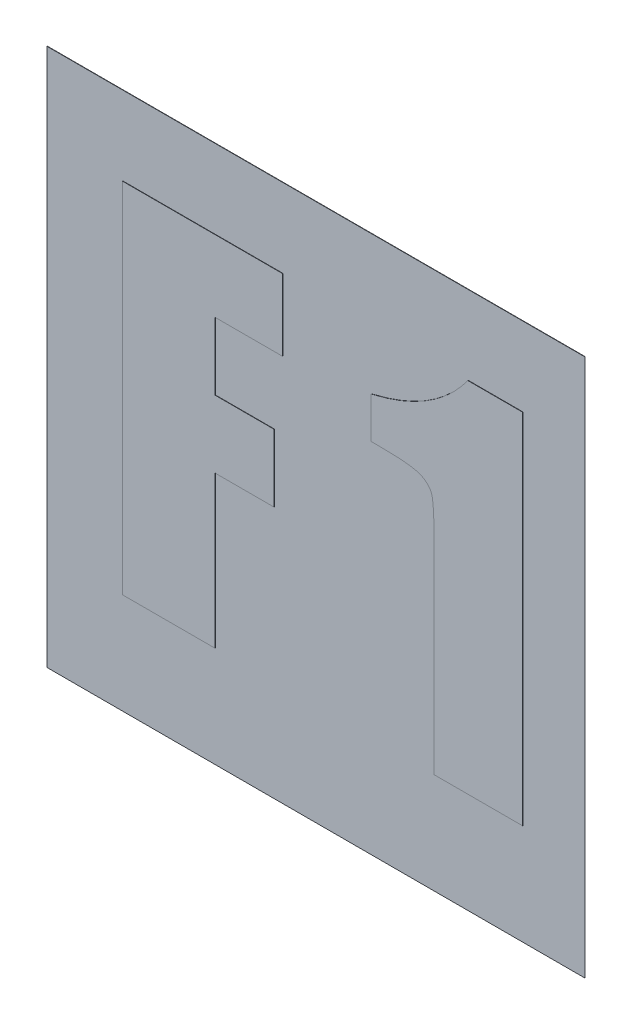
ISO-10303-21;
HEADER;
FILE_DESCRIPTION(('STEP AP214'),'2;1');
FILE_NAME('part.step','',(''),(''),'','','');
FILE_SCHEMA(('AUTOMOTIVE_DESIGN { 1 0 10303 214 1 1 1 1 }'));
ENDSEC;
DATA;
#1=APPLICATION_CONTEXT('core data for automotive mechanical design processes');
#2=APPLICATION_PROTOCOL_DEFINITION('international standard','automotive_design',2000,#1);
#3=PRODUCT_CONTEXT('',#1,'mechanical');
#4=PRODUCT('Part','Part','',(#3));
#5=PRODUCT_RELATED_PRODUCT_CATEGORY('part','',(#4));
#6=PRODUCT_DEFINITION_FORMATION('','',#4);
#7=PRODUCT_DEFINITION_CONTEXT('part definition',#1,'design');
#8=PRODUCT_DEFINITION('design','',#6,#7);
#9=PRODUCT_DEFINITION_SHAPE('','',#8);
#10=(LENGTH_UNIT() NAMED_UNIT(*) SI_UNIT(.MILLI.,.METRE.));
#11=(NAMED_UNIT(*) PLANE_ANGLE_UNIT() SI_UNIT($,.RADIAN.));
#12=(NAMED_UNIT(*) SI_UNIT($,.STERADIAN.) SOLID_ANGLE_UNIT());
#13=UNCERTAINTY_MEASURE_WITH_UNIT(LENGTH_MEASURE(1.E-05),#10,'distance_accuracy_value','');
#14=(GEOMETRIC_REPRESENTATION_CONTEXT(3) GLOBAL_UNCERTAINTY_ASSIGNED_CONTEXT((#13)) GLOBAL_UNIT_ASSIGNED_CONTEXT((#10,
#11,#12)) REPRESENTATION_CONTEXT('',''));
#15=CARTESIAN_POINT('',(0.,0.,0.));
#16=DIRECTION('',(0.,0.,1.));
#17=DIRECTION('',(1.,0.,0.));
#18=AXIS2_PLACEMENT_3D('',#15,#16,#17);
#19=CARTESIAN_POINT('',(-7.50000000000019,7.49999999999995,0.00999999999999959));
#20=DIRECTION('',(1.,0.,0.));
#21=DIRECTION('',(0.,0.,-1.));
#22=AXIS2_PLACEMENT_3D('',#19,#20,#21);
#23=PLANE('',#22);
#24=DIRECTION('',(0.,-1.,0.));
#25=VECTOR('',#24,1.);
#26=CARTESIAN_POINT('',(-7.50000000000019,7.49999999999995,0.));
#27=LINE('',#26,#25);
#28=CARTESIAN_POINT('',(-7.50000000000019,7.49999999999995,0.));
#29=VERTEX_POINT('',#28);
#30=CARTESIAN_POINT('',(-7.49999999999999,-7.5,0.));
#31=VERTEX_POINT('',#30);
#32=EDGE_CURVE('E338',#29,#31,#27,.T.);
#33=ORIENTED_EDGE('',*,*,#32,.T.);
#34=DIRECTION('',(0.,0.,-1.));
#35=VECTOR('',#34,1.);
#36=CARTESIAN_POINT('',(-7.49999999999999,-7.5,0.0100000000000482));
#37=LINE('',#36,#35);
#38=CARTESIAN_POINT('',(-7.49999999999999,-7.5,0.0100000000000482));
#39=VERTEX_POINT('',#38);
#40=EDGE_CURVE('E11',#39,#31,#37,.T.);
#41=ORIENTED_EDGE('',*,*,#40,.F.);
#42=DIRECTION('',(0.,-1.,0.));
#43=VECTOR('',#42,1.);
#44=CARTESIAN_POINT('',(-7.50000000000019,7.49999999999995,0.00999999999999959));
#45=LINE('',#44,#43);
#46=CARTESIAN_POINT('',(-7.50000000000019,7.49999999999995,0.00999999999999959));
#47=VERTEX_POINT('',#46);
#48=EDGE_CURVE('E345',#47,#39,#45,.T.);
#49=ORIENTED_EDGE('',*,*,#48,.F.);
#50=DIRECTION('',(0.,0.,-1.));
#51=VECTOR('',#50,1.);
#52=CARTESIAN_POINT('',(-7.50000000000019,7.49999999999995,0.00999999999999959));
#53=LINE('',#52,#51);
#54=EDGE_CURVE('E358',#47,#29,#53,.T.);
#55=ORIENTED_EDGE('',*,*,#54,.T.);
#56=EDGE_LOOP('',(#33,#41,#49,#55));
#57=FACE_BOUND('',#56,.T.);
#58=ADVANCED_FACE('F34',(#57),#23,.F.);
#59=CARTESIAN_POINT('',(-7.49999999999999,-7.5,0.0100000000000482));
#60=DIRECTION('',(0.,1.,0.));
#61=DIRECTION('',(-1.,0.,0.));
#62=AXIS2_PLACEMENT_3D('',#59,#60,#61);
#63=PLANE('',#62);
#64=DIRECTION('',(1.,0.,0.));
#65=VECTOR('',#64,1.);
#66=CARTESIAN_POINT('',(-7.49999999999999,-7.5,0.));
#67=LINE('',#66,#65);
#68=CARTESIAN_POINT('',(7.50000000000001,-7.5,0.));
#69=VERTEX_POINT('',#68);
#70=EDGE_CURVE('E331',#31,#69,#67,.T.);
#71=ORIENTED_EDGE('',*,*,#70,.T.);
#72=DIRECTION('',(0.,0.,-1.));
#73=VECTOR('',#72,1.);
#74=CARTESIAN_POINT('',(7.50000000000001,-7.5,0.0100000000000482));
#75=LINE('',#74,#73);
#76=CARTESIAN_POINT('',(7.50000000000001,-7.5,0.0100000000000482));
#77=VERTEX_POINT('',#76);
#78=EDGE_CURVE('E41',#77,#69,#75,.T.);
#79=ORIENTED_EDGE('',*,*,#78,.F.);
#80=DIRECTION('',(1.,0.,0.));
#81=VECTOR('',#80,1.);
#82=CARTESIAN_POINT('',(-7.49999999999999,-7.5,0.0100000000000482));
#83=LINE('',#82,#81);
#84=EDGE_CURVE('E351',#39,#77,#83,.T.);
#85=ORIENTED_EDGE('',*,*,#84,.F.);
#86=ORIENTED_EDGE('',*,*,#40,.T.);
#87=EDGE_LOOP('',(#71,#79,#85,#86));
#88=FACE_BOUND('',#87,.T.);
#89=ADVANCED_FACE('F321',(#88),#63,.F.);
#90=CARTESIAN_POINT('',(7.49999999999981,7.49999999999995,0.00999999999999959));
#91=DIRECTION('',(1.,0.,0.));
#92=DIRECTION('',(0.,1.,0.));
#93=AXIS2_PLACEMENT_3D('',#90,#91,#92);
#94=PLANE('',#93);
#95=DIRECTION('',(0.,-1.,0.));
#96=VECTOR('',#95,1.);
#97=CARTESIAN_POINT('',(7.49999999999981,7.49999999999995,0.));
#98=LINE('',#97,#96);
#99=CARTESIAN_POINT('',(7.49999999999981,7.49999999999995,0.));
#100=VERTEX_POINT('',#99);
#101=EDGE_CURVE('E337',#100,#69,#98,.T.);
#102=ORIENTED_EDGE('',*,*,#101,.F.);
#103=DIRECTION('',(0.,0.,-1.));
#104=VECTOR('',#103,1.);
#105=CARTESIAN_POINT('',(7.49999999999981,7.49999999999995,0.00999999999999959));
#106=LINE('',#105,#104);
#107=CARTESIAN_POINT('',(7.49999999999981,7.49999999999995,0.00999999999999959));
#108=VERTEX_POINT('',#107);
#109=EDGE_CURVE('E360',#108,#100,#106,.T.);
#110=ORIENTED_EDGE('',*,*,#109,.F.);
#111=DIRECTION('',(0.,-1.,0.));
#112=VECTOR('',#111,1.);
#113=CARTESIAN_POINT('',(7.49999999999981,7.49999999999995,0.00999999999999959));
#114=LINE('',#113,#112);
#115=EDGE_CURVE('E353',#108,#77,#114,.T.);
#116=ORIENTED_EDGE('',*,*,#115,.T.);
#117=ORIENTED_EDGE('',*,*,#78,.T.);
#118=EDGE_LOOP('',(#102,#110,#116,#117));
#119=FACE_BOUND('',#118,.T.);
#120=ADVANCED_FACE('F318',(#119),#94,.T.);
#121=CARTESIAN_POINT('',(-7.50000000000019,7.49999999999995,0.00999999999999959));
#122=DIRECTION('',(0.,1.,0.));
#123=DIRECTION('',(-1.,0.,0.));
#124=AXIS2_PLACEMENT_3D('',#121,#122,#123);
#125=PLANE('',#124);
#126=DIRECTION('',(1.,0.,0.));
#127=VECTOR('',#126,1.);
#128=CARTESIAN_POINT('',(-7.50000000000019,7.49999999999995,0.));
#129=LINE('',#128,#127);
#130=EDGE_CURVE('E343',#29,#100,#129,.T.);
#131=ORIENTED_EDGE('',*,*,#130,.F.);
#132=ORIENTED_EDGE('',*,*,#54,.F.);
#133=DIRECTION('',(1.,0.,0.));
#134=VECTOR('',#133,1.);
#135=CARTESIAN_POINT('',(-7.50000000000019,7.49999999999995,0.00999999999999959));
#136=LINE('',#135,#134);
#137=EDGE_CURVE('E355',#47,#108,#136,.T.);
#138=ORIENTED_EDGE('',*,*,#137,.T.);
#139=ORIENTED_EDGE('',*,*,#109,.T.);
#140=EDGE_LOOP('',(#131,#132,#138,#139));
#141=FACE_BOUND('',#140,.T.);
#142=ADVANCED_FACE('F315',(#141),#125,.T.);
#143=CARTESIAN_POINT('',(-7.49999999999999,-7.5,0.0100000000000482));
#144=DIRECTION('',(0.,0.,1.));
#145=DIRECTION('',(1.,0.,0.));
#146=AXIS2_PLACEMENT_3D('',#143,#144,#145);
#147=PLANE('',#146);
#148=DIRECTION('',(1.,0.,0.));
#149=VECTOR('',#148,1.);
#150=CARTESIAN_POINT('',(4.25102720417646,5.30620508526175,0.00999999999999959));
#151=LINE('',#150,#149);
#152=CARTESIAN_POINT('',(4.25102720417646,5.30620508526175,0.00999999999999959));
#153=VERTEX_POINT('',#152);
#154=CARTESIAN_POINT('',(5.7786575222082,5.30620508526175,0.00999999999999959));
#155=VERTEX_POINT('',#154);
#156=EDGE_CURVE('E179',#153,#155,#151,.T.);
#157=ORIENTED_EDGE('',*,*,#156,.T.);
#158=DIRECTION('',(0.,-1.,0.));
#159=VECTOR('',#158,1.);
#160=CARTESIAN_POINT('',(5.7786575222082,5.30620508526175,0.00999999999999959));
#161=LINE('',#160,#159);
#162=CARTESIAN_POINT('',(5.77865752220819,-4.68214699417644,0.0100000000000013));
#163=VERTEX_POINT('',#162);
#164=EDGE_CURVE('E184',#155,#163,#161,.T.);
#165=ORIENTED_EDGE('',*,*,#164,.T.);
#166=DIRECTION('',(-1.,0.,0.));
#167=VECTOR('',#166,1.);
#168=CARTESIAN_POINT('',(5.77865752220819,-4.68214699417644,0.0100000000000013));
#169=LINE('',#168,#167);
#170=CARTESIAN_POINT('',(3.31094700846462,-4.68214699417644,0.0100000000000482));
#171=VERTEX_POINT('',#170);
#172=EDGE_CURVE('E201',#163,#171,#169,.T.);
#173=ORIENTED_EDGE('',*,*,#172,.T.);
#174=DIRECTION('',(0.,1.,0.));
#175=VECTOR('',#174,1.);
#176=CARTESIAN_POINT('',(3.31094700846462,-4.68214699417644,0.0100000000000482));
#177=LINE('',#176,#175);
#178=CARTESIAN_POINT('',(3.31094700846462,0.631509424554149,0.00999999999999959));
#179=VERTEX_POINT('',#178);
#180=EDGE_CURVE('E203',#171,#179,#177,.T.);
#181=ORIENTED_EDGE('',*,*,#180,.T.);
#182=CARTESIAN_POINT('',(3.31094700846462,0.631509424554149,0.00999999999999959));
#183=CARTESIAN_POINT('',(3.31136534185449,0.722705918786677,0.00999999999999959));
#184=CARTESIAN_POINT('',(3.31215712914519,0.895315198463909,0.00999999999995276));
#185=CARTESIAN_POINT('',(3.30690294130744,1.14009935917591,0.0100000000000013));
#186=CARTESIAN_POINT('',(3.30511508280956,1.35622730677476,0.00999999999999959));
#187=CARTESIAN_POINT('',(3.29663727046386,1.54346287477058,0.00999999999999959));
#188=CARTESIAN_POINT('',(3.28975424181252,1.70201105743384,0.00999999999999959));
#189=CARTESIAN_POINT('',(3.2821028599736,1.83206033463699,0.00999999999999959));
#190=CARTESIAN_POINT('',(3.26862911865251,1.93293708402681,0.00999999999999959));
#191=CARTESIAN_POINT('',(3.25345280921914,2.02912551291581,0.0100000000000482));
#192=CARTESIAN_POINT('',(3.21836429937752,2.12624554261422,0.0100000000000482));
#193=CARTESIAN_POINT('',(3.14990288727421,2.22474242688727,0.0100000000000482));
#194=CARTESIAN_POINT('',(3.05502703646487,2.30592508016406,0.00999999999999959));
#195=CARTESIAN_POINT('',(2.9578503867028,2.3616613918659,0.00999999999999959));
#196=CARTESIAN_POINT('',(2.86133248028707,2.3977214657765,0.00999999999999959));
#197=CARTESIAN_POINT('',(2.76735475315159,2.41975424078444,0.00999999999999959));
#198=CARTESIAN_POINT('',(2.65499962266617,2.44292421799235,0.00999999999999959));
#199=CARTESIAN_POINT('',(2.52227048089988,2.45790062782124,0.00999999999999959));
#200=CARTESIAN_POINT('',(2.36982748560647,2.47080812923626,0.00999999999999959));
#201=CARTESIAN_POINT('',(2.1977430363276,2.47951879258933,0.00999999999999959));
#202=CARTESIAN_POINT('',(2.00613368784123,2.48506441645844,0.00999999999999959));
#203=CARTESIAN_POINT('',(1.87206589013775,2.48565462625352,0.00999999999999959));
#204=CARTESIAN_POINT('',(1.80167763175538,2.48596449812633,0.00999999999999959));
#205=B_SPLINE_CURVE_WITH_KNOTS('',3,(#182,#183,#184,#185,#186,#187,#188,#189,#190,#191,#192,
#193,#194,#195,#196,#197,#198,#199,#200,#201,#202,#203,#204),.UNSPECIFIED.,.F.,.F.,(4,1,1,1,1,1,
1,1,1,1,1,1,1,1,1,1,1,1,1,1,4),(0.,0.0904501160008813,0.171196595889161,0.242838519586019,
0.304804984240174,0.357067530513476,0.40027466378574,0.433931616403436,0.457984806631075,
0.496778910697185,0.535171981997752,0.575603367920009,0.619650947363388,0.645584038969963,
0.677533441738937,0.71527306920741,0.759320648650789,0.809884483888911,0.86702764059554,
0.930186868496366,1.),.UNSPECIFIED.);
#206=CARTESIAN_POINT('',(1.80167763175538,2.48596449812633,0.00999999999999959));
#207=VERTEX_POINT('',#206);
#208=EDGE_CURVE('E207',#179,#207,#205,.T.);
#209=ORIENTED_EDGE('',*,*,#208,.T.);
#210=DIRECTION('',(-1.,0.,0.));
#211=VECTOR('',#210,1.);
#212=CARTESIAN_POINT('',(1.80167763175538,2.48596449812633,0.00999999999999959));
#213=LINE('',#212,#211);
#214=CARTESIAN_POINT('',(1.54829664150492,2.48596449812633,0.00999999999999959));
#215=VERTEX_POINT('',#214);
#216=EDGE_CURVE('E211',#207,#215,#213,.T.);
#217=ORIENTED_EDGE('',*,*,#216,.T.);
#218=DIRECTION('',(0.,1.,0.));
#219=VECTOR('',#218,1.);
#220=CARTESIAN_POINT('',(1.54829664150492,2.48596449812633,0.00999999999999959));
#221=LINE('',#220,#219);
#222=CARTESIAN_POINT('',(1.54829664150492,3.63168723665013,0.00999999999999959));
#223=VERTEX_POINT('',#222);
#224=EDGE_CURVE('E53',#215,#223,#221,.T.);
#225=ORIENTED_EDGE('',*,*,#224,.T.);
#226=CARTESIAN_POINT('',(1.54829664150492,3.63168723665013,0.00999999999999959));
#227=CARTESIAN_POINT('',(1.69276894458921,3.66800867186069,0.00999999999999959));
#228=CARTESIAN_POINT('',(1.97564937978669,3.73912696360247,0.00999999999999959));
#229=CARTESIAN_POINT('',(2.38156825399764,3.88183239483942,0.00999999999999959));
#230=CARTESIAN_POINT('',(2.76146191361407,4.05062867393342,0.00999999999995276));
#231=CARTESIAN_POINT('',(3.11452453012127,4.24679378951516,0.00999999999999959));
#232=CARTESIAN_POINT('',(3.440527613945,4.47045182866792,0.00999999999999959));
#233=CARTESIAN_POINT('',(3.73897155697586,4.72159819649799,0.00999999999999959));
#234=CARTESIAN_POINT('',(4.01307970016345,4.99831209648328,0.00999999999995276));
#235=CARTESIAN_POINT('',(4.17164973603012,5.20349433815546,0.0100000000000013));
#236=CARTESIAN_POINT('',(4.25102720417646,5.30620508526175,0.00999999999999959));
#237=B_SPLINE_CURVE_WITH_KNOTS('',3,(#226,#227,#228,#229,#230,#231,#232,#233,#234,#235,#236),
.UNSPECIFIED.,.F.,.F.,(4,1,1,1,1,1,1,1,4),(0.,0.137436331686156,0.269103824673197,
0.396548472630132,0.520712192052874,0.64136184335631,0.760846104037571,0.880283619442499,1.),.UNSPECIFIED.);
#238=EDGE_CURVE('E48',#223,#153,#237,.T.);
#239=ORIENTED_EDGE('',*,*,#238,.T.);
#240=EDGE_LOOP('',(#157,#165,#173,#181,#209,#217,#225,#239));
#241=FACE_BOUND('',#240,.T.);
#242=DIRECTION('',(0.,1.,0.));
#243=VECTOR('',#242,1.);
#244=CARTESIAN_POINT('',(-5.38479480186989,-4.68214699417644,0.0100000000000482));
#245=LINE('',#244,#243);
#246=CARTESIAN_POINT('',(-5.38479480186989,-4.68214699417644,0.0100000000000482));
#247=VERTEX_POINT('',#246);
#248=CARTESIAN_POINT('',(-5.38479480186988,5.30620508526175,0.00999999999999959));
#249=VERTEX_POINT('',#248);
#250=EDGE_CURVE('E444',#247,#249,#245,.T.);
#251=ORIENTED_EDGE('',*,*,#250,.T.);
#252=DIRECTION('',(1.,0.,0.));
#253=VECTOR('',#252,1.);
#254=CARTESIAN_POINT('',(-5.38479480186988,5.30620508526175,0.00999999999999959));
#255=LINE('',#254,#253);
#256=CARTESIAN_POINT('',(-0.91941387223865,5.30620508526175,0.00999999999995102));
#257=VERTEX_POINT('',#256);
#258=EDGE_CURVE('E442',#249,#257,#255,.T.);
#259=ORIENTED_EDGE('',*,*,#258,.T.);
#260=DIRECTION('',(0.,-1.,0.));
#261=VECTOR('',#260,1.);
#262=CARTESIAN_POINT('',(-0.91941387223865,5.30620508526175,0.00999999999995102));
#263=LINE('',#262,#261);
#264=CARTESIAN_POINT('',(-0.919413872238456,3.30853466937419,0.00999999999999959));
#265=VERTEX_POINT('',#264);
#266=EDGE_CURVE('E440',#257,#265,#263,.T.);
#267=ORIENTED_EDGE('',*,*,#266,.T.);
#268=DIRECTION('',(-1.,0.,0.));
#269=VECTOR('',#268,1.);
#270=CARTESIAN_POINT('',(-0.919413872238456,3.30853466937419,0.00999999999999959));
#271=LINE('',#270,#269);
#272=CARTESIAN_POINT('',(-2.79957426366213,3.30853466937416,0.00999999999999959));
#273=VERTEX_POINT('',#272);
#274=EDGE_CURVE('E438',#265,#273,#271,.T.);
#275=ORIENTED_EDGE('',*,*,#274,.T.);
#276=DIRECTION('',(0.,-1.,0.));
#277=VECTOR('',#276,1.);
#278=CARTESIAN_POINT('',(-2.79957426366213,3.30853466937416,0.00999999999999959));
#279=LINE('',#278,#277);
#280=CARTESIAN_POINT('',(-2.79957426366213,1.42837427795049,0.00999999999999959));
#281=VERTEX_POINT('',#280);
#282=EDGE_CURVE('E436',#273,#281,#279,.T.);
#283=ORIENTED_EDGE('',*,*,#282,.T.);
#284=DIRECTION('',(1.,0.,0.));
#285=VECTOR('',#284,1.);
#286=CARTESIAN_POINT('',(-2.79957426366213,1.42837427795049,0.00999999999999959));
#287=LINE('',#286,#285);
#288=CARTESIAN_POINT('',(-1.15443392116642,1.42837427795051,0.0100000000000499));
#289=VERTEX_POINT('',#288);
#290=EDGE_CURVE('E434',#281,#289,#287,.T.);
#291=ORIENTED_EDGE('',*,*,#290,.T.);
#292=DIRECTION('',(0.,-1.,0.));
#293=VECTOR('',#292,1.);
#294=CARTESIAN_POINT('',(-1.15443392116642,1.42837427795051,0.0100000000000499));
#295=LINE('',#294,#293);
#296=CARTESIAN_POINT('',(-1.1544339211666,-0.451786113473177,0.00999999999999959));
#297=VERTEX_POINT('',#296);
#298=EDGE_CURVE('E432',#289,#297,#295,.T.);
#299=ORIENTED_EDGE('',*,*,#298,.T.);
#300=DIRECTION('',(-1.,0.,0.));
#301=VECTOR('',#300,1.);
#302=CARTESIAN_POINT('',(-1.1544339211666,-0.451786113473177,0.00999999999999959));
#303=LINE('',#302,#301);
#304=CARTESIAN_POINT('',(-2.79957426366232,-0.451786113473165,0.0100000000000482));
#305=VERTEX_POINT('',#304);
#306=EDGE_CURVE('E430',#297,#305,#303,.T.);
#307=ORIENTED_EDGE('',*,*,#306,.T.);
#308=DIRECTION('',(0.,-1.,0.));
#309=VECTOR('',#308,1.);
#310=CARTESIAN_POINT('',(-2.79957426366232,-0.451786113473165,0.0100000000000482));
#311=LINE('',#310,#309);
#312=CARTESIAN_POINT('',(-2.79957426366233,-4.68214699417648,0.0100000000000482));
#313=VERTEX_POINT('',#312);
#314=EDGE_CURVE('E428',#305,#313,#311,.T.);
#315=ORIENTED_EDGE('',*,*,#314,.T.);
#316=DIRECTION('',(-1.,0.,0.));
#317=VECTOR('',#316,1.);
#318=CARTESIAN_POINT('',(-2.79957426366233,-4.68214699417648,0.0100000000000482));
#319=LINE('',#318,#317);
#320=EDGE_CURVE('E426',#313,#247,#319,.T.);
#321=ORIENTED_EDGE('',*,*,#320,.T.);
#322=EDGE_LOOP('',(#251,#259,#267,#275,#283,#291,#299,#307,#315,#321));
#323=FACE_BOUND('',#322,.T.);
#324=ORIENTED_EDGE('',*,*,#48,.T.);
#325=ORIENTED_EDGE('',*,*,#84,.T.);
#326=ORIENTED_EDGE('',*,*,#115,.F.);
#327=ORIENTED_EDGE('',*,*,#137,.F.);
#328=EDGE_LOOP('',(#324,#325,#326,#327));
#329=FACE_BOUND('',#328,.T.);
#330=ADVANCED_FACE('F181',(#241,#323,#329),#147,.T.);
#331=CARTESIAN_POINT('',(-7.49999999999999,-7.5,0.));
#332=DIRECTION('',(0.,0.,1.));
#333=DIRECTION('',(1.,0.,0.));
#334=AXIS2_PLACEMENT_3D('',#331,#332,#333);
#335=PLANE('',#334);
#336=ORIENTED_EDGE('',*,*,#32,.F.);
#337=ORIENTED_EDGE('',*,*,#130,.T.);
#338=ORIENTED_EDGE('',*,*,#101,.T.);
#339=ORIENTED_EDGE('',*,*,#70,.F.);
#340=EDGE_LOOP('',(#336,#337,#338,#339));
#341=FACE_BOUND('',#340,.T.);
#342=ADVANCED_FACE('F308',(#341),#335,.F.);
#343=CARTESIAN_POINT('',(-5.38479480186989,-4.68214699417644,0.0200000000000478));
#344=DIRECTION('',(-1.,0.,0.));
#345=DIRECTION('',(0.,0.,1.));
#346=AXIS2_PLACEMENT_3D('',#343,#344,#345);
#347=PLANE('',#346);
#348=ORIENTED_EDGE('',*,*,#250,.F.);
#349=DIRECTION('',(0.,0.,-1.));
#350=VECTOR('',#349,1.);
#351=CARTESIAN_POINT('',(-5.38479480186989,-4.68214699417644,0.0200000000000478));
#352=LINE('',#351,#350);
#353=CARTESIAN_POINT('',(-5.38479480186989,-4.68214699417644,0.0200000000000478));
#354=VERTEX_POINT('',#353);
#355=EDGE_CURVE('E365',#354,#247,#352,.T.);
#356=ORIENTED_EDGE('',*,*,#355,.F.);
#357=DIRECTION('',(0.,1.,0.));
#358=VECTOR('',#357,1.);
#359=CARTESIAN_POINT('',(-5.38479480186989,-4.68214699417644,0.0200000000000478));
#360=LINE('',#359,#358);
#361=CARTESIAN_POINT('',(-5.38479480186988,5.30620508526175,0.0199999999999992));
#362=VERTEX_POINT('',#361);
#363=EDGE_CURVE('E423',#354,#362,#360,.T.);
#364=ORIENTED_EDGE('',*,*,#363,.T.);
#365=DIRECTION('',(0.,0.,-1.));
#366=VECTOR('',#365,1.);
#367=CARTESIAN_POINT('',(-5.38479480186988,5.30620508526175,0.0199999999999992));
#368=LINE('',#367,#366);
#369=EDGE_CURVE('E370',#362,#249,#368,.T.);
#370=ORIENTED_EDGE('',*,*,#369,.T.);
#371=EDGE_LOOP('',(#348,#356,#364,#370));
#372=FACE_BOUND('',#371,.T.);
#373=ADVANCED_FACE('F274',(#372),#347,.T.);
#374=CARTESIAN_POINT('',(-2.79957426366233,-4.68214699417648,0.0200000000000478));
#375=DIRECTION('',(0.,-1.,0.));
#376=DIRECTION('',(0.,0.,-1.));
#377=AXIS2_PLACEMENT_3D('',#374,#375,#376);
#378=PLANE('',#377);
#379=ORIENTED_EDGE('',*,*,#320,.F.);
#380=DIRECTION('',(0.,0.,-1.));
#381=VECTOR('',#380,1.);
#382=CARTESIAN_POINT('',(-2.79957426366233,-4.68214699417648,0.0200000000000478));
#383=LINE('',#382,#381);
#384=CARTESIAN_POINT('',(-2.79957426366233,-4.68214699417648,0.0200000000000478));
#385=VERTEX_POINT('',#384);
#386=EDGE_CURVE('E367',#385,#313,#383,.T.);
#387=ORIENTED_EDGE('',*,*,#386,.F.);
#388=DIRECTION('',(-1.,0.,0.));
#389=VECTOR('',#388,1.);
#390=CARTESIAN_POINT('',(-2.79957426366233,-4.68214699417648,0.0200000000000478));
#391=LINE('',#390,#389);
#392=EDGE_CURVE('E374',#385,#354,#391,.T.);
#393=ORIENTED_EDGE('',*,*,#392,.T.);
#394=ORIENTED_EDGE('',*,*,#355,.T.);
#395=EDGE_LOOP('',(#379,#387,#393,#394));
#396=FACE_BOUND('',#395,.T.);
#397=ADVANCED_FACE('F270',(#396),#378,.T.);
#398=CARTESIAN_POINT('',(-2.79957426366232,-0.451786113473165,0.0200000000000495));
#399=DIRECTION('',(1.,0.,0.));
#400=DIRECTION('',(0.,0.,-1.));
#401=AXIS2_PLACEMENT_3D('',#398,#399,#400);
#402=PLANE('',#401);
#403=ORIENTED_EDGE('',*,*,#314,.F.);
#404=DIRECTION('',(0.,0.,-1.));
#405=VECTOR('',#404,1.);
#406=CARTESIAN_POINT('',(-2.79957426366232,-0.451786113473165,0.0200000000000495));
#407=LINE('',#406,#405);
#408=CARTESIAN_POINT('',(-2.79957426366232,-0.451786113473165,0.0200000000000495));
#409=VERTEX_POINT('',#408);
#410=EDGE_CURVE('E392',#409,#305,#407,.T.);
#411=ORIENTED_EDGE('',*,*,#410,.F.);
#412=DIRECTION('',(0.,-1.,0.));
#413=VECTOR('',#412,1.);
#414=CARTESIAN_POINT('',(-2.79957426366232,-0.451786113473165,0.0200000000000495));
#415=LINE('',#414,#413);
#416=EDGE_CURVE('E399',#409,#385,#415,.T.);
#417=ORIENTED_EDGE('',*,*,#416,.T.);
#418=ORIENTED_EDGE('',*,*,#386,.T.);
#419=EDGE_LOOP('',(#403,#411,#417,#418));
#420=FACE_BOUND('',#419,.T.);
#421=ADVANCED_FACE('F273',(#420),#402,.T.);
#422=CARTESIAN_POINT('',(-1.1544339211666,-0.451786113473177,0.0199999999999992));
#423=DIRECTION('',(0.,-1.,0.));
#424=DIRECTION('',(0.,0.,-1.));
#425=AXIS2_PLACEMENT_3D('',#422,#423,#424);
#426=PLANE('',#425);
#427=ORIENTED_EDGE('',*,*,#306,.F.);
#428=DIRECTION('',(0.,0.,-1.));
#429=VECTOR('',#428,1.);
#430=CARTESIAN_POINT('',(-1.1544339211666,-0.451786113473177,0.0199999999999992));
#431=LINE('',#430,#429);
#432=CARTESIAN_POINT('',(-1.1544339211666,-0.451786113473177,0.0199999999999992));
#433=VERTEX_POINT('',#432);
#434=EDGE_CURVE('E389',#433,#297,#431,.T.);
#435=ORIENTED_EDGE('',*,*,#434,.F.);
#436=DIRECTION('',(-1.,0.,0.));
#437=VECTOR('',#436,1.);
#438=CARTESIAN_POINT('',(-1.1544339211666,-0.451786113473177,0.0199999999999992));
#439=LINE('',#438,#437);
#440=EDGE_CURVE('E402',#433,#409,#439,.T.);
#441=ORIENTED_EDGE('',*,*,#440,.T.);
#442=ORIENTED_EDGE('',*,*,#410,.T.);
#443=EDGE_LOOP('',(#427,#435,#441,#442));
#444=FACE_BOUND('',#443,.T.);
#445=ADVANCED_FACE('F278',(#444),#426,.T.);
#446=CARTESIAN_POINT('',(-1.15443392116642,1.42837427795051,0.0200000000000495));
#447=DIRECTION('',(1.,0.,0.));
#448=DIRECTION('',(0.,0.,-1.));
#449=AXIS2_PLACEMENT_3D('',#446,#447,#448);
#450=PLANE('',#449);
#451=ORIENTED_EDGE('',*,*,#298,.F.);
#452=DIRECTION('',(0.,0.,-1.));
#453=VECTOR('',#452,1.);
#454=CARTESIAN_POINT('',(-1.15443392116642,1.42837427795051,0.0200000000000495));
#455=LINE('',#454,#453);
#456=CARTESIAN_POINT('',(-1.15443392116642,1.42837427795051,0.0200000000000495));
#457=VERTEX_POINT('',#456);
#458=EDGE_CURVE('E386',#457,#289,#455,.T.);
#459=ORIENTED_EDGE('',*,*,#458,.F.);
#460=DIRECTION('',(0.,-1.,0.));
#461=VECTOR('',#460,1.);
#462=CARTESIAN_POINT('',(-1.15443392116642,1.42837427795051,0.0200000000000495));
#463=LINE('',#462,#461);
#464=EDGE_CURVE('E405',#457,#433,#463,.T.);
#465=ORIENTED_EDGE('',*,*,#464,.T.);
#466=ORIENTED_EDGE('',*,*,#434,.T.);
#467=EDGE_LOOP('',(#451,#459,#465,#466));
#468=FACE_BOUND('',#467,.T.);
#469=ADVANCED_FACE('F282',(#468),#450,.T.);
#470=CARTESIAN_POINT('',(-2.79957426366213,1.42837427795049,0.0199999999999992));
#471=DIRECTION('',(0.,1.,0.));
#472=DIRECTION('',(0.,0.,1.));
#473=AXIS2_PLACEMENT_3D('',#470,#471,#472);
#474=PLANE('',#473);
#475=ORIENTED_EDGE('',*,*,#290,.F.);
#476=DIRECTION('',(0.,0.,-1.));
#477=VECTOR('',#476,1.);
#478=CARTESIAN_POINT('',(-2.79957426366213,1.42837427795049,0.0199999999999992));
#479=LINE('',#478,#477);
#480=CARTESIAN_POINT('',(-2.79957426366213,1.42837427795049,0.0199999999999992));
#481=VERTEX_POINT('',#480);
#482=EDGE_CURVE('E383',#481,#281,#479,.T.);
#483=ORIENTED_EDGE('',*,*,#482,.F.);
#484=DIRECTION('',(1.,0.,0.));
#485=VECTOR('',#484,1.);
#486=CARTESIAN_POINT('',(-2.79957426366213,1.42837427795049,0.0199999999999992));
#487=LINE('',#486,#485);
#488=EDGE_CURVE('E408',#481,#457,#487,.T.);
#489=ORIENTED_EDGE('',*,*,#488,.T.);
#490=ORIENTED_EDGE('',*,*,#458,.T.);
#491=EDGE_LOOP('',(#475,#483,#489,#490));
#492=FACE_BOUND('',#491,.T.);
#493=ADVANCED_FACE('F286',(#492),#474,.T.);
#494=CARTESIAN_POINT('',(-2.79957426366213,3.30853466937416,0.0199999999999992));
#495=DIRECTION('',(1.,0.,0.));
#496=DIRECTION('',(0.,0.,-1.));
#497=AXIS2_PLACEMENT_3D('',#494,#495,#496);
#498=PLANE('',#497);
#499=ORIENTED_EDGE('',*,*,#282,.F.);
#500=DIRECTION('',(0.,0.,-1.));
#501=VECTOR('',#500,1.);
#502=CARTESIAN_POINT('',(-2.79957426366213,3.30853466937416,0.0199999999999992));
#503=LINE('',#502,#501);
#504=CARTESIAN_POINT('',(-2.79957426366213,3.30853466937416,0.0199999999999992));
#505=VERTEX_POINT('',#504);
#506=EDGE_CURVE('E380',#505,#273,#503,.T.);
#507=ORIENTED_EDGE('',*,*,#506,.F.);
#508=DIRECTION('',(0.,-1.,0.));
#509=VECTOR('',#508,1.);
#510=CARTESIAN_POINT('',(-2.79957426366213,3.30853466937416,0.0199999999999992));
#511=LINE('',#510,#509);
#512=EDGE_CURVE('E411',#505,#481,#511,.T.);
#513=ORIENTED_EDGE('',*,*,#512,.T.);
#514=ORIENTED_EDGE('',*,*,#482,.T.);
#515=EDGE_LOOP('',(#499,#507,#513,#514));
#516=FACE_BOUND('',#515,.T.);
#517=ADVANCED_FACE('F290',(#516),#498,.T.);
#518=CARTESIAN_POINT('',(-0.919413872238456,3.30853466937419,0.0200000000000009));
#519=DIRECTION('',(0.,-1.,0.));
#520=DIRECTION('',(0.,0.,-1.));
#521=AXIS2_PLACEMENT_3D('',#518,#519,#520);
#522=PLANE('',#521);
#523=ORIENTED_EDGE('',*,*,#274,.F.);
#524=DIRECTION('',(0.,0.,-1.));
#525=VECTOR('',#524,1.);
#526=CARTESIAN_POINT('',(-0.919413872238456,3.30853466937419,0.0200000000000009));
#527=LINE('',#526,#525);
#528=CARTESIAN_POINT('',(-0.919413872238456,3.30853466937419,0.0200000000000009));
#529=VERTEX_POINT('',#528);
#530=EDGE_CURVE('E377',#529,#265,#527,.T.);
#531=ORIENTED_EDGE('',*,*,#530,.F.);
#532=DIRECTION('',(-1.,0.,0.));
#533=VECTOR('',#532,1.);
#534=CARTESIAN_POINT('',(-0.919413872238456,3.30853466937419,0.0200000000000009));
#535=LINE('',#534,#533);
#536=EDGE_CURVE('E414',#529,#505,#535,.T.);
#537=ORIENTED_EDGE('',*,*,#536,.T.);
#538=ORIENTED_EDGE('',*,*,#506,.T.);
#539=EDGE_LOOP('',(#523,#531,#537,#538));
#540=FACE_BOUND('',#539,.T.);
#541=ADVANCED_FACE('F294',(#540),#522,.T.);
#542=CARTESIAN_POINT('',(-0.91941387223865,5.30620508526175,0.0199999999999506));
#543=DIRECTION('',(1.,0.,0.));
#544=DIRECTION('',(0.,0.,-1.));
#545=AXIS2_PLACEMENT_3D('',#542,#543,#544);
#546=PLANE('',#545);
#547=ORIENTED_EDGE('',*,*,#266,.F.);
#548=DIRECTION('',(0.,0.,-1.));
#549=VECTOR('',#548,1.);
#550=CARTESIAN_POINT('',(-0.91941387223865,5.30620508526175,0.0199999999999506));
#551=LINE('',#550,#549);
#552=CARTESIAN_POINT('',(-0.91941387223865,5.30620508526175,0.0199999999999506));
#553=VERTEX_POINT('',#552);
#554=EDGE_CURVE('E373',#553,#257,#551,.T.);
#555=ORIENTED_EDGE('',*,*,#554,.F.);
#556=DIRECTION('',(0.,-1.,0.));
#557=VECTOR('',#556,1.);
#558=CARTESIAN_POINT('',(-0.91941387223865,5.30620508526175,0.0199999999999506));
#559=LINE('',#558,#557);
#560=EDGE_CURVE('E417',#553,#529,#559,.T.);
#561=ORIENTED_EDGE('',*,*,#560,.T.);
#562=ORIENTED_EDGE('',*,*,#530,.T.);
#563=EDGE_LOOP('',(#547,#555,#561,#562));
#564=FACE_BOUND('',#563,.T.);
#565=ADVANCED_FACE('F298',(#564),#546,.T.);
#566=CARTESIAN_POINT('',(-5.38479480186988,5.30620508526175,0.0199999999999992));
#567=DIRECTION('',(0.,1.,0.));
#568=DIRECTION('',(0.,0.,1.));
#569=AXIS2_PLACEMENT_3D('',#566,#567,#568);
#570=PLANE('',#569);
#571=ORIENTED_EDGE('',*,*,#258,.F.);
#572=ORIENTED_EDGE('',*,*,#369,.F.);
#573=DIRECTION('',(1.,0.,0.));
#574=VECTOR('',#573,1.);
#575=CARTESIAN_POINT('',(-5.38479480186988,5.30620508526175,0.0199999999999992));
#576=LINE('',#575,#574);
#577=EDGE_CURVE('E420',#362,#553,#576,.T.);
#578=ORIENTED_EDGE('',*,*,#577,.T.);
#579=ORIENTED_EDGE('',*,*,#554,.T.);
#580=EDGE_LOOP('',(#571,#572,#578,#579));
#581=FACE_BOUND('',#580,.T.);
#582=ADVANCED_FACE('F268',(#581),#570,.T.);
#583=CARTESIAN_POINT('',(-5.38479480186988,5.30620508526175,0.0199999999999992));
#584=DIRECTION('',(0.,0.,-1.));
#585=DIRECTION('',(-1.,0.,0.));
#586=AXIS2_PLACEMENT_3D('',#583,#584,#585);
#587=PLANE('',#586);
#588=ORIENTED_EDGE('',*,*,#363,.F.);
#589=ORIENTED_EDGE('',*,*,#392,.F.);
#590=ORIENTED_EDGE('',*,*,#416,.F.);
#591=ORIENTED_EDGE('',*,*,#440,.F.);
#592=ORIENTED_EDGE('',*,*,#464,.F.);
#593=ORIENTED_EDGE('',*,*,#488,.F.);
#594=ORIENTED_EDGE('',*,*,#512,.F.);
#595=ORIENTED_EDGE('',*,*,#536,.F.);
#596=ORIENTED_EDGE('',*,*,#560,.F.);
#597=ORIENTED_EDGE('',*,*,#577,.F.);
#598=EDGE_LOOP('',(#588,#589,#590,#591,#592,#593,#594,#595,#596,#597));
#599=FACE_BOUND('',#598,.T.);
#600=ADVANCED_FACE('F265',(#599),#587,.F.);
#601=CARTESIAN_POINT('',(4.25102720417646,5.30620508526175,0.0200000000000009));
#602=DIRECTION('',(0.,1.,0.));
#603=DIRECTION('',(0.,0.,1.));
#604=AXIS2_PLACEMENT_3D('',#601,#602,#603);
#605=PLANE('',#604);
#606=ORIENTED_EDGE('',*,*,#156,.F.);
#607=DIRECTION('',(0.,0.,-1.));
#608=VECTOR('',#607,1.);
#609=CARTESIAN_POINT('',(4.25102720417646,5.30620508526175,0.0200000000000009));
#610=LINE('',#609,#608);
#611=CARTESIAN_POINT('',(4.25102720417646,5.30620508526175,0.0200000000000009));
#612=VERTEX_POINT('',#611);
#613=EDGE_CURVE('E445',#612,#153,#610,.T.);
#614=ORIENTED_EDGE('',*,*,#613,.F.);
#615=DIRECTION('',(1.,0.,0.));
#616=VECTOR('',#615,1.);
#617=CARTESIAN_POINT('',(4.25102720417646,5.30620508526175,0.0200000000000009));
#618=LINE('',#617,#616);
#619=CARTESIAN_POINT('',(5.7786575222082,5.30620508526175,0.0199999999999992));
#620=VERTEX_POINT('',#619);
#621=EDGE_CURVE('E192',#612,#620,#618,.T.);
#622=ORIENTED_EDGE('',*,*,#621,.T.);
#623=DIRECTION('',(0.,0.,-1.));
#624=VECTOR('',#623,1.);
#625=CARTESIAN_POINT('',(5.7786575222082,5.30620508526175,0.0199999999999992));
#626=LINE('',#625,#624);
#627=EDGE_CURVE('E189',#620,#155,#626,.T.);
#628=ORIENTED_EDGE('',*,*,#627,.T.);
#629=EDGE_LOOP('',(#606,#614,#622,#628));
#630=FACE_BOUND('',#629,.T.);
#631=ADVANCED_FACE('F190',(#630),#605,.T.);
#632=CARTESIAN_POINT('',(1.54829664150492,3.63168723665013,0.0200000000000009));
#633=CARTESIAN_POINT('',(1.69276894458921,3.66800867186069,0.0200000000000009));
#634=CARTESIAN_POINT('',(1.97564937978669,3.73912696360247,0.0199999999999992));
#635=CARTESIAN_POINT('',(2.38156825399764,3.88183239483942,0.0199999999999992));
#636=CARTESIAN_POINT('',(2.76146191361407,4.05062867393342,0.0199999999999523));
#637=CARTESIAN_POINT('',(3.11452453012127,4.24679378951516,0.0200000000000009));
#638=CARTESIAN_POINT('',(3.440527613945,4.47045182866792,0.0199999999999992));
#639=CARTESIAN_POINT('',(3.73897155697586,4.72159819649799,0.0199999999999992));
#640=CARTESIAN_POINT('',(4.01307970016345,4.99831209648328,0.0199999999999523));
#641=CARTESIAN_POINT('',(4.17164973603012,5.20349433815546,0.0200000000000009));
#642=CARTESIAN_POINT('',(4.25102720417646,5.30620508526175,0.0200000000000009));
#643=B_SPLINE_CURVE_WITH_KNOTS('',3,(#632,#633,#634,#635,#636,#637,#638,#639,#640,#641,#642),
.UNSPECIFIED.,.F.,.F.,(4,1,1,1,1,1,1,1,4),(0.,0.137436331686156,0.269103824673197,
0.396548472630132,0.520712192052874,0.64136184335631,0.760846104037571,0.880283619442499,1.),.UNSPECIFIED.);
#644=DIRECTION('',(0.,0.,-1.));
#645=VECTOR('',#644,1.);
#646=SURFACE_OF_LINEAR_EXTRUSION('',#643,#645);
#647=ORIENTED_EDGE('',*,*,#238,.F.);
#648=DIRECTION('',(0.,0.,-1.));
#649=VECTOR('',#648,1.);
#650=CARTESIAN_POINT('',(1.54829664150492,3.63168723665013,0.0200000000000009));
#651=LINE('',#650,#649);
#652=CARTESIAN_POINT('',(1.54829664150492,3.63168723665013,0.0200000000000009));
#653=VERTEX_POINT('',#652);
#654=EDGE_CURVE('E460',#653,#223,#651,.T.);
#655=ORIENTED_EDGE('',*,*,#654,.F.);
#656=EDGE_CURVE('E197',#653,#612,#643,.T.);
#657=ORIENTED_EDGE('',*,*,#656,.T.);
#658=ORIENTED_EDGE('',*,*,#613,.T.);
#659=EDGE_LOOP('',(#647,#655,#657,#658));
#660=FACE_BOUND('',#659,.T.);
#661=ADVANCED_FACE('F264',(#660),#646,.T.);
#662=CARTESIAN_POINT('',(1.54829664150492,2.48596449812633,0.0199999999999992));
#663=DIRECTION('',(-1.,0.,0.));
#664=DIRECTION('',(0.,0.,1.));
#665=AXIS2_PLACEMENT_3D('',#662,#663,#664);
#666=PLANE('',#665);
#667=ORIENTED_EDGE('',*,*,#224,.F.);
#668=DIRECTION('',(0.,0.,-1.));
#669=VECTOR('',#668,1.);
#670=CARTESIAN_POINT('',(1.54829664150492,2.48596449812633,0.0199999999999992));
#671=LINE('',#670,#669);
#672=CARTESIAN_POINT('',(1.54829664150492,2.48596449812633,0.0199999999999992));
#673=VERTEX_POINT('',#672);
#674=EDGE_CURVE('E457',#673,#215,#671,.T.);
#675=ORIENTED_EDGE('',*,*,#674,.F.);
#676=DIRECTION('',(0.,1.,0.));
#677=VECTOR('',#676,1.);
#678=CARTESIAN_POINT('',(1.54829664150492,2.48596449812633,0.0199999999999992));
#679=LINE('',#678,#677);
#680=EDGE_CURVE('E467',#673,#653,#679,.T.);
#681=ORIENTED_EDGE('',*,*,#680,.T.);
#682=ORIENTED_EDGE('',*,*,#654,.T.);
#683=EDGE_LOOP('',(#667,#675,#681,#682));
#684=FACE_BOUND('',#683,.T.);
#685=ADVANCED_FACE('F474',(#684),#666,.T.);
#686=CARTESIAN_POINT('',(1.80167763175538,2.48596449812633,0.0199999999999992));
#687=DIRECTION('',(0.,-1.,0.));
#688=DIRECTION('',(0.,0.,-1.));
#689=AXIS2_PLACEMENT_3D('',#686,#687,#688);
#690=PLANE('',#689);
#691=ORIENTED_EDGE('',*,*,#216,.F.);
#692=DIRECTION('',(0.,0.,-1.));
#693=VECTOR('',#692,1.);
#694=CARTESIAN_POINT('',(1.80167763175538,2.48596449812633,0.0199999999999992));
#695=LINE('',#694,#693);
#696=CARTESIAN_POINT('',(1.80167763175538,2.48596449812633,0.0199999999999992));
#697=VERTEX_POINT('',#696);
#698=EDGE_CURVE('E454',#697,#207,#695,.T.);
#699=ORIENTED_EDGE('',*,*,#698,.F.);
#700=DIRECTION('',(-1.,0.,0.));
#701=VECTOR('',#700,1.);
#702=CARTESIAN_POINT('',(1.80167763175538,2.48596449812633,0.0199999999999992));
#703=LINE('',#702,#701);
#704=EDGE_CURVE('E238',#697,#673,#703,.T.);
#705=ORIENTED_EDGE('',*,*,#704,.T.);
#706=ORIENTED_EDGE('',*,*,#674,.T.);
#707=EDGE_LOOP('',(#691,#699,#705,#706));
#708=FACE_BOUND('',#707,.T.);
#709=ADVANCED_FACE('F249',(#708),#690,.T.);
#710=CARTESIAN_POINT('',(3.31094700846462,0.631509424554149,0.0199999999999992));
#711=CARTESIAN_POINT('',(3.31136534185449,0.722705918786677,0.0199999999999992));
#712=CARTESIAN_POINT('',(3.31215712914519,0.895315198463909,0.0199999999999523));
#713=CARTESIAN_POINT('',(3.30690294130744,1.14009935917591,0.0200000000000009));
#714=CARTESIAN_POINT('',(3.30511508280956,1.35622730677476,0.0200000000000009));
#715=CARTESIAN_POINT('',(3.29663727046386,1.54346287477058,0.0199999999999992));
#716=CARTESIAN_POINT('',(3.28975424181252,1.70201105743384,0.0199999999999992));
#717=CARTESIAN_POINT('',(3.2821028599736,1.83206033463699,0.0199999999999992));
#718=CARTESIAN_POINT('',(3.26862911865251,1.93293708402681,0.0199999999999992));
#719=CARTESIAN_POINT('',(3.25345280921914,2.02912551291581,0.0200000000000478));
#720=CARTESIAN_POINT('',(3.21836429937752,2.12624554261422,0.0200000000000478));
#721=CARTESIAN_POINT('',(3.14990288727421,2.22474242688727,0.0200000000000478));
#722=CARTESIAN_POINT('',(3.05502703646487,2.30592508016406,0.0199999999999992));
#723=CARTESIAN_POINT('',(2.9578503867028,2.3616613918659,0.0199999999999992));
#724=CARTESIAN_POINT('',(2.86133248028707,2.3977214657765,0.0199999999999992));
#725=CARTESIAN_POINT('',(2.76735475315159,2.41975424078444,0.0199999999999992));
#726=CARTESIAN_POINT('',(2.65499962266617,2.44292421799235,0.0199999999999992));
#727=CARTESIAN_POINT('',(2.52227048089988,2.45790062782124,0.0199999999999992));
#728=CARTESIAN_POINT('',(2.36982748560647,2.47080812923626,0.0199999999999992));
#729=CARTESIAN_POINT('',(2.1977430363276,2.47951879258933,0.0199999999999992));
#730=CARTESIAN_POINT('',(2.00613368784123,2.48506441645844,0.0199999999999992));
#731=CARTESIAN_POINT('',(1.87206589013775,2.48565462625352,0.0199999999999992));
#732=CARTESIAN_POINT('',(1.80167763175538,2.48596449812633,0.0199999999999992));
#733=B_SPLINE_CURVE_WITH_KNOTS('',3,(#710,#711,#712,#713,#714,#715,#716,#717,#718,#719,#720,
#721,#722,#723,#724,#725,#726,#727,#728,#729,#730,#731,#732),.UNSPECIFIED.,.F.,.F.,(4,1,1,1,1,1,
1,1,1,1,1,1,1,1,1,1,1,1,1,1,4),(0.,0.0904501160008813,0.171196595889161,0.242838519586019,
0.304804984240174,0.357067530513476,0.40027466378574,0.433931616403436,0.457984806631075,
0.496778910697185,0.535171981997752,0.575603367920009,0.619650947363388,0.645584038969963,
0.677533441738937,0.71527306920741,0.759320648650789,0.809884483888911,0.86702764059554,
0.930186868496366,1.),.UNSPECIFIED.);
#734=DIRECTION('',(0.,0.,-1.));
#735=VECTOR('',#734,1.);
#736=SURFACE_OF_LINEAR_EXTRUSION('',#733,#735);
#737=ORIENTED_EDGE('',*,*,#208,.F.);
#738=DIRECTION('',(0.,0.,-1.));
#739=VECTOR('',#738,1.);
#740=CARTESIAN_POINT('',(3.31094700846462,0.631509424554149,0.0199999999999992));
#741=LINE('',#740,#739);
#742=CARTESIAN_POINT('',(3.31094700846462,0.631509424554149,0.0199999999999992));
#743=VERTEX_POINT('',#742);
#744=EDGE_CURVE('E451',#743,#179,#741,.T.);
#745=ORIENTED_EDGE('',*,*,#744,.F.);
#746=EDGE_CURVE('E232',#743,#697,#733,.T.);
#747=ORIENTED_EDGE('',*,*,#746,.T.);
#748=ORIENTED_EDGE('',*,*,#698,.T.);
#749=EDGE_LOOP('',(#737,#745,#747,#748));
#750=FACE_BOUND('',#749,.T.);
#751=ADVANCED_FACE('F244',(#750),#736,.T.);
#752=CARTESIAN_POINT('',(3.31094700846462,-4.68214699417644,0.0200000000000495));
#753=DIRECTION('',(-1.,0.,0.));
#754=DIRECTION('',(0.,0.,1.));
#755=AXIS2_PLACEMENT_3D('',#752,#753,#754);
#756=PLANE('',#755);
#757=ORIENTED_EDGE('',*,*,#180,.F.);
#758=DIRECTION('',(0.,0.,-1.));
#759=VECTOR('',#758,1.);
#760=CARTESIAN_POINT('',(3.31094700846462,-4.68214699417644,0.0200000000000495));
#761=LINE('',#760,#759);
#762=CARTESIAN_POINT('',(3.31094700846462,-4.68214699417644,0.0200000000000495));
#763=VERTEX_POINT('',#762);
#764=EDGE_CURVE('E448',#763,#171,#761,.T.);
#765=ORIENTED_EDGE('',*,*,#764,.F.);
#766=DIRECTION('',(0.,1.,0.));
#767=VECTOR('',#766,1.);
#768=CARTESIAN_POINT('',(3.31094700846462,-4.68214699417644,0.0200000000000495));
#769=LINE('',#768,#767);
#770=EDGE_CURVE('E229',#763,#743,#769,.T.);
#771=ORIENTED_EDGE('',*,*,#770,.T.);
#772=ORIENTED_EDGE('',*,*,#744,.T.);
#773=EDGE_LOOP('',(#757,#765,#771,#772));
#774=FACE_BOUND('',#773,.T.);
#775=ADVANCED_FACE('F248',(#774),#756,.T.);
#776=CARTESIAN_POINT('',(5.77865752220819,-4.68214699417644,0.0200000000000009));
#777=DIRECTION('',(0.,-1.,0.));
#778=DIRECTION('',(0.,0.,-1.));
#779=AXIS2_PLACEMENT_3D('',#776,#777,#778);
#780=PLANE('',#779);
#781=ORIENTED_EDGE('',*,*,#172,.F.);
#782=DIRECTION('',(0.,0.,-1.));
#783=VECTOR('',#782,1.);
#784=CARTESIAN_POINT('',(5.77865752220819,-4.68214699417644,0.0200000000000009));
#785=LINE('',#784,#783);
#786=CARTESIAN_POINT('',(5.77865752220819,-4.68214699417644,0.0200000000000009));
#787=VERTEX_POINT('',#786);
#788=EDGE_CURVE('E196',#787,#163,#785,.T.);
#789=ORIENTED_EDGE('',*,*,#788,.F.);
#790=DIRECTION('',(-1.,0.,0.));
#791=VECTOR('',#790,1.);
#792=CARTESIAN_POINT('',(5.77865752220819,-4.68214699417644,0.0200000000000009));
#793=LINE('',#792,#791);
#794=EDGE_CURVE('E226',#787,#763,#793,.T.);
#795=ORIENTED_EDGE('',*,*,#794,.T.);
#796=ORIENTED_EDGE('',*,*,#764,.T.);
#797=EDGE_LOOP('',(#781,#789,#795,#796));
#798=FACE_BOUND('',#797,.T.);
#799=ADVANCED_FACE('F254',(#798),#780,.T.);
#800=CARTESIAN_POINT('',(5.7786575222082,5.30620508526175,0.0199999999999992));
#801=DIRECTION('',(1.,0.,0.));
#802=DIRECTION('',(0.,0.,-1.));
#803=AXIS2_PLACEMENT_3D('',#800,#801,#802);
#804=PLANE('',#803);
#805=ORIENTED_EDGE('',*,*,#164,.F.);
#806=ORIENTED_EDGE('',*,*,#627,.F.);
#807=DIRECTION('',(0.,-1.,0.));
#808=VECTOR('',#807,1.);
#809=CARTESIAN_POINT('',(5.7786575222082,5.30620508526175,0.0199999999999992));
#810=LINE('',#809,#808);
#811=EDGE_CURVE('E224',#620,#787,#810,.T.);
#812=ORIENTED_EDGE('',*,*,#811,.T.);
#813=ORIENTED_EDGE('',*,*,#788,.T.);
#814=EDGE_LOOP('',(#805,#806,#812,#813));
#815=FACE_BOUND('',#814,.T.);
#816=ADVANCED_FACE('F199',(#815),#804,.T.);
#817=CARTESIAN_POINT('',(3.20904681420209,2.13288230171294,0.0200000000000478));
#818=DIRECTION('',(0.,0.,-1.));
#819=DIRECTION('',(-1.,0.,0.));
#820=AXIS2_PLACEMENT_3D('',#817,#818,#819);
#821=PLANE('',#820);
#822=ORIENTED_EDGE('',*,*,#621,.F.);
#823=ORIENTED_EDGE('',*,*,#656,.F.);
#824=ORIENTED_EDGE('',*,*,#680,.F.);
#825=ORIENTED_EDGE('',*,*,#704,.F.);
#826=ORIENTED_EDGE('',*,*,#746,.F.);
#827=ORIENTED_EDGE('',*,*,#770,.F.);
#828=ORIENTED_EDGE('',*,*,#794,.F.);
#829=ORIENTED_EDGE('',*,*,#811,.F.);
#830=EDGE_LOOP('',(#822,#823,#824,#825,#826,#827,#828,#829));
#831=FACE_BOUND('',#830,.T.);
#832=ADVANCED_FACE('F261',(#831),#821,.F.);
#833=CLOSED_SHELL('',(#58,#89,#120,#142,#330,#342,#373,#397,#421,#445,#469,#493,#517,#541,#565,
#582,#600,#631,#661,#685,#709,#751,#775,#799,#816,#832));
#834=MANIFOLD_SOLID_BREP('B2',#833);
#835=ADVANCED_BREP_SHAPE_REPRESENTATION('',(#18,#834),#14);
#836=SHAPE_DEFINITION_REPRESENTATION(#9,#835);
ENDSEC;
END-ISO-10303-21;
